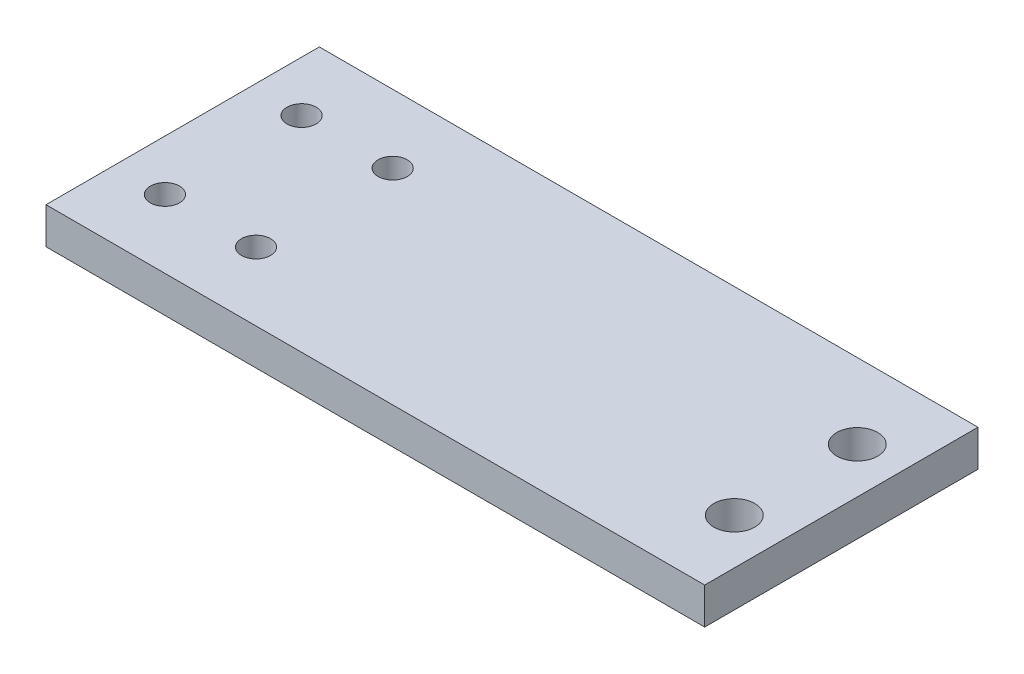
ISO-10303-21;
HEADER;
FILE_DESCRIPTION(('STEP AP214'),'2;1');
FILE_NAME('part.step','',(''),(''),'','','');
FILE_SCHEMA(('AUTOMOTIVE_DESIGN { 1 0 10303 214 1 1 1 1 }'));
ENDSEC;
DATA;
#1=APPLICATION_CONTEXT('core data for automotive mechanical design processes');
#2=APPLICATION_PROTOCOL_DEFINITION('international standard','automotive_design',2000,#1);
#3=PRODUCT_CONTEXT('',#1,'mechanical');
#4=PRODUCT('Part','Part','',(#3));
#5=PRODUCT_RELATED_PRODUCT_CATEGORY('part','',(#4));
#6=PRODUCT_DEFINITION_FORMATION('','',#4);
#7=PRODUCT_DEFINITION_CONTEXT('part definition',#1,'design');
#8=PRODUCT_DEFINITION('design','',#6,#7);
#9=PRODUCT_DEFINITION_SHAPE('','',#8);
#10=(LENGTH_UNIT() NAMED_UNIT(*) SI_UNIT(.MILLI.,.METRE.));
#11=(NAMED_UNIT(*) PLANE_ANGLE_UNIT() SI_UNIT($,.RADIAN.));
#12=(NAMED_UNIT(*) SI_UNIT($,.STERADIAN.) SOLID_ANGLE_UNIT());
#13=UNCERTAINTY_MEASURE_WITH_UNIT(LENGTH_MEASURE(1.E-05),#10,'distance_accuracy_value','');
#14=(GEOMETRIC_REPRESENTATION_CONTEXT(3) GLOBAL_UNCERTAINTY_ASSIGNED_CONTEXT((#13)) GLOBAL_UNIT_ASSIGNED_CONTEXT((#10,
#11,#12)) REPRESENTATION_CONTEXT('',''));
#15=CARTESIAN_POINT('',(0.,0.,0.));
#16=DIRECTION('',(0.,0.,1.));
#17=DIRECTION('',(1.,0.,0.));
#18=AXIS2_PLACEMENT_3D('',#15,#16,#17);
#19=CARTESIAN_POINT('',(0.,4.,0.));
#20=DIRECTION('',(0.,-1.,0.));
#21=DIRECTION('',(0.,0.,-1.));
#22=AXIS2_PLACEMENT_3D('',#19,#20,#21);
#23=PLANE('',#22);
#24=DIRECTION('',(-1.,0.,0.));
#25=VECTOR('',#24,1.);
#26=CARTESIAN_POINT('',(48.5545112781955,4.,-22.9980174917397));
#27=LINE('',#26,#25);
#28=CARTESIAN_POINT('',(48.5545112781955,4.,-22.9980174917397));
#29=VERTEX_POINT('',#28);
#30=CARTESIAN_POINT('',(-23.7481969242923,4.,-22.9980174917397));
#31=VERTEX_POINT('',#30);
#32=EDGE_CURVE('E88',#29,#31,#27,.T.);
#33=ORIENTED_EDGE('',*,*,#32,.T.);
#34=DIRECTION('',(0.,0.,1.));
#35=VECTOR('',#34,1.);
#36=CARTESIAN_POINT('',(-23.7481969242923,4.,7.00198250826034));
#37=LINE('',#36,#35);
#38=CARTESIAN_POINT('',(-23.7481969242923,4.,7.00198250826034));
#39=VERTEX_POINT('',#38);
#40=EDGE_CURVE('E83',#31,#39,#37,.T.);
#41=ORIENTED_EDGE('',*,*,#40,.T.);
#42=DIRECTION('',(1.,0.,0.));
#43=VECTOR('',#42,1.);
#44=CARTESIAN_POINT('',(48.5545112781955,4.,7.00198250826033));
#45=LINE('',#44,#43);
#46=CARTESIAN_POINT('',(48.5545112781955,4.,7.00198250826033));
#47=VERTEX_POINT('',#46);
#48=EDGE_CURVE('E86',#39,#47,#45,.T.);
#49=ORIENTED_EDGE('',*,*,#48,.T.);
#50=DIRECTION('',(0.,0.,-1.));
#51=VECTOR('',#50,1.);
#52=CARTESIAN_POINT('',(48.5545112781955,4.,-22.9980174917397));
#53=LINE('',#52,#51);
#54=EDGE_CURVE('E53',#47,#29,#53,.T.);
#55=ORIENTED_EDGE('',*,*,#54,.T.);
#56=EDGE_LOOP('',(#33,#41,#49,#55));
#57=FACE_BOUND('',#56,.T.);
#58=CARTESIAN_POINT('',(-18.1954887218045,4.,-15.4980174917397));
#59=DIRECTION('',(0.,1.,0.));
#60=DIRECTION('',(0.,0.,1.));
#61=AXIS2_PLACEMENT_3D('',#58,#59,#60);
#62=CIRCLE('',#61,1.6);
#63=CARTESIAN_POINT('',(-18.1954887218045,4.,-13.8980174917397));
#64=VERTEX_POINT('',#63);
#65=EDGE_CURVE('E103',#64,#64,#62,.T.);
#66=ORIENTED_EDGE('',*,*,#65,.F.);
#67=EDGE_LOOP('',(#66));
#68=FACE_BOUND('',#67,.T.);
#69=CARTESIAN_POINT('',(-18.1954887218045,4.,-0.498017491739666));
#70=DIRECTION('',(0.,1.,0.));
#71=DIRECTION('',(0.,0.,1.));
#72=AXIS2_PLACEMENT_3D('',#69,#70,#71);
#73=CIRCLE('',#72,1.6);
#74=CARTESIAN_POINT('',(-18.1954887218045,4.,1.10198250826034));
#75=VERTEX_POINT('',#74);
#76=EDGE_CURVE('E118',#75,#75,#73,.T.);
#77=ORIENTED_EDGE('',*,*,#76,.F.);
#78=EDGE_LOOP('',(#77));
#79=FACE_BOUND('',#78,.T.);
#80=CARTESIAN_POINT('',(-8.19548872180451,4.,-15.4980174917397));
#81=DIRECTION('',(0.,1.,0.));
#82=DIRECTION('',(0.,0.,1.));
#83=AXIS2_PLACEMENT_3D('',#80,#81,#82);
#84=CIRCLE('',#83,1.6);
#85=CARTESIAN_POINT('',(-8.19548872180451,4.,-13.8980174917397));
#86=VERTEX_POINT('',#85);
#87=EDGE_CURVE('E124',#86,#86,#84,.T.);
#88=ORIENTED_EDGE('',*,*,#87,.F.);
#89=EDGE_LOOP('',(#88));
#90=FACE_BOUND('',#89,.T.);
#91=CARTESIAN_POINT('',(-8.19548872180451,4.,-0.498017491739668));
#92=DIRECTION('',(0.,1.,0.));
#93=DIRECTION('',(0.,0.,1.));
#94=AXIS2_PLACEMENT_3D('',#91,#92,#93);
#95=CIRCLE('',#94,1.6);
#96=CARTESIAN_POINT('',(-8.19548872180451,4.,1.10198250826033));
#97=VERTEX_POINT('',#96);
#98=EDGE_CURVE('E130',#97,#97,#95,.T.);
#99=ORIENTED_EDGE('',*,*,#98,.F.);
#100=EDGE_LOOP('',(#99));
#101=FACE_BOUND('',#100,.T.);
#102=CARTESIAN_POINT('',(43.5545112781955,4.,-14.7480174917397));
#103=DIRECTION('',(0.,1.,0.));
#104=DIRECTION('',(0.,0.,1.));
#105=AXIS2_PLACEMENT_3D('',#102,#103,#104);
#106=CIRCLE('',#105,2.25);
#107=CARTESIAN_POINT('',(43.5545112781955,4.,-12.4980174917397));
#108=VERTEX_POINT('',#107);
#109=EDGE_CURVE('E136',#108,#108,#106,.T.);
#110=ORIENTED_EDGE('',*,*,#109,.F.);
#111=EDGE_LOOP('',(#110));
#112=FACE_BOUND('',#111,.T.);
#113=CARTESIAN_POINT('',(43.5545112781955,4.,-1.24801749173967));
#114=DIRECTION('',(0.,1.,0.));
#115=DIRECTION('',(0.,0.,-1.));
#116=AXIS2_PLACEMENT_3D('',#113,#114,#115);
#117=CIRCLE('',#116,2.25);
#118=CARTESIAN_POINT('',(43.5545112781955,4.,-3.49801749173967));
#119=VERTEX_POINT('',#118);
#120=EDGE_CURVE('E142',#119,#119,#117,.T.);
#121=ORIENTED_EDGE('',*,*,#120,.F.);
#122=EDGE_LOOP('',(#121));
#123=FACE_BOUND('',#122,.T.);
#124=ADVANCED_FACE('F36',(#57,#68,#79,#90,#101,#112,#123),#23,.F.);
#125=CARTESIAN_POINT('',(0.,0.,0.));
#126=DIRECTION('',(0.,-1.,0.));
#127=DIRECTION('',(0.,0.,-1.));
#128=AXIS2_PLACEMENT_3D('',#125,#126,#127);
#129=PLANE('',#128);
#130=CARTESIAN_POINT('',(43.5545112781955,0.,-14.7480174917397));
#131=DIRECTION('',(0.,1.,0.));
#132=DIRECTION('',(0.,0.,1.));
#133=AXIS2_PLACEMENT_3D('',#130,#131,#132);
#134=CIRCLE('',#133,2.25);
#135=CARTESIAN_POINT('',(43.5545112781955,0.,-12.4980174917397));
#136=VERTEX_POINT('',#135);
#137=EDGE_CURVE('E139',#136,#136,#134,.T.);
#138=ORIENTED_EDGE('',*,*,#137,.T.);
#139=EDGE_LOOP('',(#138));
#140=FACE_BOUND('',#139,.T.);
#141=CARTESIAN_POINT('',(-8.19548872180451,0.,-15.4980174917397));
#142=DIRECTION('',(0.,1.,0.));
#143=DIRECTION('',(0.,0.,1.));
#144=AXIS2_PLACEMENT_3D('',#141,#142,#143);
#145=CIRCLE('',#144,1.6);
#146=CARTESIAN_POINT('',(-8.19548872180451,0.,-13.8980174917397));
#147=VERTEX_POINT('',#146);
#148=EDGE_CURVE('E127',#147,#147,#145,.T.);
#149=ORIENTED_EDGE('',*,*,#148,.T.);
#150=EDGE_LOOP('',(#149));
#151=FACE_BOUND('',#150,.T.);
#152=CARTESIAN_POINT('',(-18.1954887218045,0.,-15.4980174917397));
#153=DIRECTION('',(0.,1.,0.));
#154=DIRECTION('',(0.,0.,1.));
#155=AXIS2_PLACEMENT_3D('',#152,#153,#154);
#156=CIRCLE('',#155,1.6);
#157=CARTESIAN_POINT('',(-18.1954887218045,0.,-13.8980174917397));
#158=VERTEX_POINT('',#157);
#159=EDGE_CURVE('E115',#158,#158,#156,.T.);
#160=ORIENTED_EDGE('',*,*,#159,.T.);
#161=EDGE_LOOP('',(#160));
#162=FACE_BOUND('',#161,.T.);
#163=DIRECTION('',(-1.,0.,0.));
#164=VECTOR('',#163,1.);
#165=CARTESIAN_POINT('',(48.5545112781955,0.,-22.9980174917397));
#166=LINE('',#165,#164);
#167=CARTESIAN_POINT('',(48.5545112781955,0.,-22.9980174917397));
#168=VERTEX_POINT('',#167);
#169=CARTESIAN_POINT('',(-23.7481969242923,0.,-22.9980174917397));
#170=VERTEX_POINT('',#169);
#171=EDGE_CURVE('E100',#168,#170,#166,.T.);
#172=ORIENTED_EDGE('',*,*,#171,.F.);
#173=DIRECTION('',(0.,0.,-1.));
#174=VECTOR('',#173,1.);
#175=CARTESIAN_POINT('',(48.5545112781955,0.,-22.9980174917397));
#176=LINE('',#175,#174);
#177=CARTESIAN_POINT('',(48.5545112781955,0.,7.00198250826033));
#178=VERTEX_POINT('',#177);
#179=EDGE_CURVE('E76',#178,#168,#176,.T.);
#180=ORIENTED_EDGE('',*,*,#179,.F.);
#181=DIRECTION('',(1.,0.,0.));
#182=VECTOR('',#181,1.);
#183=CARTESIAN_POINT('',(48.5545112781955,0.,7.00198250826033));
#184=LINE('',#183,#182);
#185=CARTESIAN_POINT('',(-23.7481969242923,0.,7.00198250826034));
#186=VERTEX_POINT('',#185);
#187=EDGE_CURVE('E70',#186,#178,#184,.T.);
#188=ORIENTED_EDGE('',*,*,#187,.F.);
#189=DIRECTION('',(0.,0.,1.));
#190=VECTOR('',#189,1.);
#191=CARTESIAN_POINT('',(-23.7481969242923,0.,7.00198250826034));
#192=LINE('',#191,#190);
#193=EDGE_CURVE('E92',#170,#186,#192,.T.);
#194=ORIENTED_EDGE('',*,*,#193,.F.);
#195=EDGE_LOOP('',(#172,#180,#188,#194));
#196=FACE_BOUND('',#195,.T.);
#197=CARTESIAN_POINT('',(-18.1954887218045,0.,-0.498017491739666));
#198=DIRECTION('',(0.,1.,0.));
#199=DIRECTION('',(0.,0.,1.));
#200=AXIS2_PLACEMENT_3D('',#197,#198,#199);
#201=CIRCLE('',#200,1.6);
#202=CARTESIAN_POINT('',(-18.1954887218045,0.,1.10198250826034));
#203=VERTEX_POINT('',#202);
#204=EDGE_CURVE('E121',#203,#203,#201,.T.);
#205=ORIENTED_EDGE('',*,*,#204,.T.);
#206=EDGE_LOOP('',(#205));
#207=FACE_BOUND('',#206,.T.);
#208=CARTESIAN_POINT('',(-8.19548872180451,0.,-0.498017491739668));
#209=DIRECTION('',(0.,1.,0.));
#210=DIRECTION('',(0.,0.,1.));
#211=AXIS2_PLACEMENT_3D('',#208,#209,#210);
#212=CIRCLE('',#211,1.6);
#213=CARTESIAN_POINT('',(-8.19548872180451,0.,1.10198250826033));
#214=VERTEX_POINT('',#213);
#215=EDGE_CURVE('E133',#214,#214,#212,.T.);
#216=ORIENTED_EDGE('',*,*,#215,.T.);
#217=EDGE_LOOP('',(#216));
#218=FACE_BOUND('',#217,.T.);
#219=CARTESIAN_POINT('',(43.5545112781955,0.,-1.24801749173967));
#220=DIRECTION('',(0.,1.,0.));
#221=DIRECTION('',(0.,0.,-1.));
#222=AXIS2_PLACEMENT_3D('',#219,#220,#221);
#223=CIRCLE('',#222,2.25);
#224=CARTESIAN_POINT('',(43.5545112781955,0.,-3.49801749173967));
#225=VERTEX_POINT('',#224);
#226=EDGE_CURVE('E145',#225,#225,#223,.T.);
#227=ORIENTED_EDGE('',*,*,#226,.T.);
#228=EDGE_LOOP('',(#227));
#229=FACE_BOUND('',#228,.T.);
#230=ADVANCED_FACE('F111',(#140,#151,#162,#196,#207,#218,#229),#129,.T.);
#231=CARTESIAN_POINT('',(48.5545112781955,4.,-22.9980174917397));
#232=DIRECTION('',(0.,0.,1.));
#233=DIRECTION('',(1.,0.,0.));
#234=AXIS2_PLACEMENT_3D('',#231,#232,#233);
#235=PLANE('',#234);
#236=ORIENTED_EDGE('',*,*,#171,.T.);
#237=DIRECTION('',(0.,-1.,0.));
#238=VECTOR('',#237,1.);
#239=CARTESIAN_POINT('',(-23.7481969242923,4.,-22.9980174917397));
#240=LINE('',#239,#238);
#241=EDGE_CURVE('E11',#31,#170,#240,.T.);
#242=ORIENTED_EDGE('',*,*,#241,.F.);
#243=ORIENTED_EDGE('',*,*,#32,.F.);
#244=DIRECTION('',(0.,-1.,0.));
#245=VECTOR('',#244,1.);
#246=CARTESIAN_POINT('',(48.5545112781955,4.,-22.9980174917397));
#247=LINE('',#246,#245);
#248=EDGE_CURVE('E96',#29,#168,#247,.T.);
#249=ORIENTED_EDGE('',*,*,#248,.T.);
#250=EDGE_LOOP('',(#236,#242,#243,#249));
#251=FACE_BOUND('',#250,.T.);
#252=ADVANCED_FACE('F38',(#251),#235,.F.);
#253=CARTESIAN_POINT('',(-23.7481969242923,4.,7.00198250826034));
#254=DIRECTION('',(1.,0.,0.));
#255=DIRECTION('',(0.,0.,-1.));
#256=AXIS2_PLACEMENT_3D('',#253,#254,#255);
#257=PLANE('',#256);
#258=ORIENTED_EDGE('',*,*,#193,.T.);
#259=DIRECTION('',(0.,-1.,0.));
#260=VECTOR('',#259,1.);
#261=CARTESIAN_POINT('',(-23.7481969242923,4.,7.00198250826034));
#262=LINE('',#261,#260);
#263=EDGE_CURVE('E45',#39,#186,#262,.T.);
#264=ORIENTED_EDGE('',*,*,#263,.F.);
#265=ORIENTED_EDGE('',*,*,#40,.F.);
#266=ORIENTED_EDGE('',*,*,#241,.T.);
#267=EDGE_LOOP('',(#258,#264,#265,#266));
#268=FACE_BOUND('',#267,.T.);
#269=ADVANCED_FACE('F91',(#268),#257,.F.);
#270=CARTESIAN_POINT('',(48.5545112781955,4.,7.00198250826033));
#271=DIRECTION('',(0.,0.,-1.));
#272=DIRECTION('',(-1.,0.,0.));
#273=AXIS2_PLACEMENT_3D('',#270,#271,#272);
#274=PLANE('',#273);
#275=ORIENTED_EDGE('',*,*,#187,.T.);
#276=DIRECTION('',(0.,-1.,0.));
#277=VECTOR('',#276,1.);
#278=CARTESIAN_POINT('',(48.5545112781955,4.,7.00198250826033));
#279=LINE('',#278,#277);
#280=EDGE_CURVE('E93',#47,#178,#279,.T.);
#281=ORIENTED_EDGE('',*,*,#280,.F.);
#282=ORIENTED_EDGE('',*,*,#48,.F.);
#283=ORIENTED_EDGE('',*,*,#263,.T.);
#284=EDGE_LOOP('',(#275,#281,#282,#283));
#285=FACE_BOUND('',#284,.T.);
#286=ADVANCED_FACE('F94',(#285),#274,.F.);
#287=CARTESIAN_POINT('',(48.5545112781955,4.,-22.9980174917397));
#288=DIRECTION('',(-1.,0.,0.));
#289=DIRECTION('',(0.,0.,1.));
#290=AXIS2_PLACEMENT_3D('',#287,#288,#289);
#291=PLANE('',#290);
#292=ORIENTED_EDGE('',*,*,#179,.T.);
#293=ORIENTED_EDGE('',*,*,#248,.F.);
#294=ORIENTED_EDGE('',*,*,#54,.F.);
#295=ORIENTED_EDGE('',*,*,#280,.T.);
#296=EDGE_LOOP('',(#292,#293,#294,#295));
#297=FACE_BOUND('',#296,.T.);
#298=ADVANCED_FACE('F108',(#297),#291,.F.);
#299=CARTESIAN_POINT('',(-18.1954887218045,4.,-15.4980174917397));
#300=DIRECTION('',(0.,-1.,0.));
#301=DIRECTION('',(0.,0.,-1.));
#302=AXIS2_PLACEMENT_3D('',#299,#300,#301);
#303=CYLINDRICAL_SURFACE('',#302,1.6);
#304=ORIENTED_EDGE('',*,*,#65,.T.);
#305=EDGE_LOOP('',(#304));
#306=FACE_BOUND('',#305,.T.);
#307=ORIENTED_EDGE('',*,*,#159,.F.);
#308=EDGE_LOOP('',(#307));
#309=FACE_BOUND('',#308,.T.);
#310=ADVANCED_FACE('F162',(#306,#309),#303,.F.);
#311=CARTESIAN_POINT('',(-18.1954887218045,4.,-0.498017491739666));
#312=DIRECTION('',(0.,-1.,0.));
#313=DIRECTION('',(0.,0.,-1.));
#314=AXIS2_PLACEMENT_3D('',#311,#312,#313);
#315=CYLINDRICAL_SURFACE('',#314,1.6);
#316=ORIENTED_EDGE('',*,*,#76,.T.);
#317=EDGE_LOOP('',(#316));
#318=FACE_BOUND('',#317,.T.);
#319=ORIENTED_EDGE('',*,*,#204,.F.);
#320=EDGE_LOOP('',(#319));
#321=FACE_BOUND('',#320,.T.);
#322=ADVANCED_FACE('F216',(#318,#321),#315,.F.);
#323=CARTESIAN_POINT('',(-8.19548872180451,4.,-15.4980174917397));
#324=DIRECTION('',(0.,-1.,0.));
#325=DIRECTION('',(0.,0.,-1.));
#326=AXIS2_PLACEMENT_3D('',#323,#324,#325);
#327=CYLINDRICAL_SURFACE('',#326,1.6);
#328=ORIENTED_EDGE('',*,*,#87,.T.);
#329=EDGE_LOOP('',(#328));
#330=FACE_BOUND('',#329,.T.);
#331=ORIENTED_EDGE('',*,*,#148,.F.);
#332=EDGE_LOOP('',(#331));
#333=FACE_BOUND('',#332,.T.);
#334=ADVANCED_FACE('F225',(#330,#333),#327,.F.);
#335=CARTESIAN_POINT('',(-8.19548872180451,4.,-0.498017491739668));
#336=DIRECTION('',(0.,-1.,0.));
#337=DIRECTION('',(0.,0.,-1.));
#338=AXIS2_PLACEMENT_3D('',#335,#336,#337);
#339=CYLINDRICAL_SURFACE('',#338,1.6);
#340=ORIENTED_EDGE('',*,*,#98,.T.);
#341=EDGE_LOOP('',(#340));
#342=FACE_BOUND('',#341,.T.);
#343=ORIENTED_EDGE('',*,*,#215,.F.);
#344=EDGE_LOOP('',(#343));
#345=FACE_BOUND('',#344,.T.);
#346=ADVANCED_FACE('F234',(#342,#345),#339,.F.);
#347=CARTESIAN_POINT('',(43.5545112781955,4.,-14.7480174917397));
#348=DIRECTION('',(0.,-1.,0.));
#349=DIRECTION('',(0.,0.,-1.));
#350=AXIS2_PLACEMENT_3D('',#347,#348,#349);
#351=CYLINDRICAL_SURFACE('',#350,2.25);
#352=ORIENTED_EDGE('',*,*,#109,.T.);
#353=EDGE_LOOP('',(#352));
#354=FACE_BOUND('',#353,.T.);
#355=ORIENTED_EDGE('',*,*,#137,.F.);
#356=EDGE_LOOP('',(#355));
#357=FACE_BOUND('',#356,.T.);
#358=ADVANCED_FACE('F244',(#354,#357),#351,.F.);
#359=CARTESIAN_POINT('',(43.5545112781955,4.,-1.24801749173967));
#360=DIRECTION('',(0.,-1.,0.));
#361=DIRECTION('',(0.,0.,-1.));
#362=AXIS2_PLACEMENT_3D('',#359,#360,#361);
#363=CYLINDRICAL_SURFACE('',#362,2.25);
#364=ORIENTED_EDGE('',*,*,#120,.T.);
#365=EDGE_LOOP('',(#364));
#366=FACE_BOUND('',#365,.T.);
#367=ORIENTED_EDGE('',*,*,#226,.F.);
#368=EDGE_LOOP('',(#367));
#369=FACE_BOUND('',#368,.T.);
#370=ADVANCED_FACE('F151',(#366,#369),#363,.F.);
#371=CLOSED_SHELL('',(#124,#230,#252,#269,#286,#298,#310,#322,#334,#346,#358,#370));
#372=MANIFOLD_SOLID_BREP('B2',#371);
#373=ADVANCED_BREP_SHAPE_REPRESENTATION('',(#18,#372),#14);
#374=SHAPE_DEFINITION_REPRESENTATION(#9,#373);
ENDSEC;
END-ISO-10303-21;
